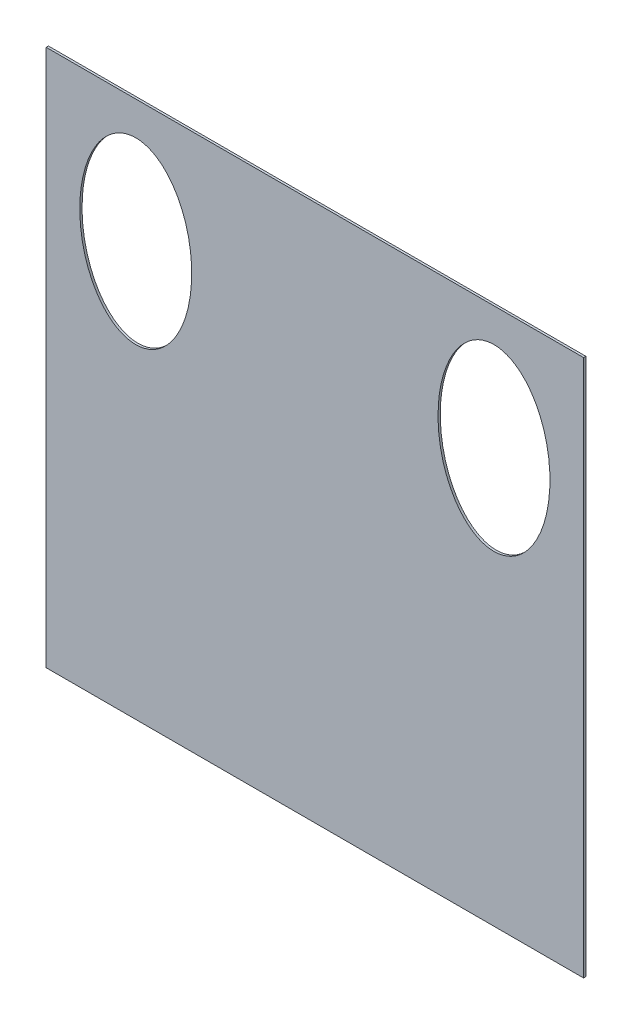
ISO-10303-21;
HEADER;
FILE_DESCRIPTION(('STEP AP214'),'2;1');
FILE_NAME('part.step','',(''),(''),'','','');
FILE_SCHEMA(('AUTOMOTIVE_DESIGN { 1 0 10303 214 1 1 1 1 }'));
ENDSEC;
DATA;
#1=APPLICATION_CONTEXT('core data for automotive mechanical design processes');
#2=APPLICATION_PROTOCOL_DEFINITION('international standard','automotive_design',2000,#1);
#3=PRODUCT_CONTEXT('',#1,'mechanical');
#4=PRODUCT('Part','Part','',(#3));
#5=PRODUCT_RELATED_PRODUCT_CATEGORY('part','',(#4));
#6=PRODUCT_DEFINITION_FORMATION('','',#4);
#7=PRODUCT_DEFINITION_CONTEXT('part definition',#1,'design');
#8=PRODUCT_DEFINITION('design','',#6,#7);
#9=PRODUCT_DEFINITION_SHAPE('','',#8);
#10=(LENGTH_UNIT() NAMED_UNIT(*) SI_UNIT(.MILLI.,.METRE.));
#11=(NAMED_UNIT(*) PLANE_ANGLE_UNIT() SI_UNIT($,.RADIAN.));
#12=(NAMED_UNIT(*) SI_UNIT($,.STERADIAN.) SOLID_ANGLE_UNIT());
#13=UNCERTAINTY_MEASURE_WITH_UNIT(LENGTH_MEASURE(1.E-05),#10,'distance_accuracy_value','');
#14=(GEOMETRIC_REPRESENTATION_CONTEXT(3) GLOBAL_UNCERTAINTY_ASSIGNED_CONTEXT((#13)) GLOBAL_UNIT_ASSIGNED_CONTEXT((#10,
#11,#12)) REPRESENTATION_CONTEXT('',''));
#15=CARTESIAN_POINT('',(0.,0.,0.));
#16=DIRECTION('',(0.,0.,1.));
#17=DIRECTION('',(1.,0.,0.));
#18=AXIS2_PLACEMENT_3D('',#15,#16,#17);
#19=CARTESIAN_POINT('',(-183.887603305785,299.132231404959,2.54));
#20=DIRECTION('',(1.,0.,0.));
#21=DIRECTION('',(0.,0.,-1.));
#22=AXIS2_PLACEMENT_3D('',#19,#20,#21);
#23=PLANE('',#22);
#24=DIRECTION('',(0.,-1.,0.));
#25=VECTOR('',#24,1.);
#26=CARTESIAN_POINT('',(-183.887603305785,299.132231404959,0.));
#27=LINE('',#26,#25);
#28=CARTESIAN_POINT('',(-183.887603305785,299.132231404959,0.));
#29=VERTEX_POINT('',#28);
#30=CARTESIAN_POINT('',(-183.887603305785,-310.467768595041,0.));
#31=VERTEX_POINT('',#30);
#32=EDGE_CURVE('E95',#29,#31,#27,.T.);
#33=ORIENTED_EDGE('',*,*,#32,.T.);
#34=DIRECTION('',(0.,0.,-1.));
#35=VECTOR('',#34,1.);
#36=CARTESIAN_POINT('',(-183.887603305785,-310.467768595041,2.54));
#37=LINE('',#36,#35);
#38=CARTESIAN_POINT('',(-183.887603305785,-310.467768595041,2.54));
#39=VERTEX_POINT('',#38);
#40=EDGE_CURVE('E11',#39,#31,#37,.T.);
#41=ORIENTED_EDGE('',*,*,#40,.F.);
#42=DIRECTION('',(0.,-1.,0.));
#43=VECTOR('',#42,1.);
#44=CARTESIAN_POINT('',(-183.887603305785,299.132231404959,2.54));
#45=LINE('',#44,#43);
#46=CARTESIAN_POINT('',(-183.887603305785,299.132231404959,2.54));
#47=VERTEX_POINT('',#46);
#48=EDGE_CURVE('E83',#47,#39,#45,.T.);
#49=ORIENTED_EDGE('',*,*,#48,.F.);
#50=DIRECTION('',(0.,0.,-1.));
#51=VECTOR('',#50,1.);
#52=CARTESIAN_POINT('',(-183.887603305785,299.132231404959,2.54));
#53=LINE('',#52,#51);
#54=EDGE_CURVE('E91',#47,#29,#53,.T.);
#55=ORIENTED_EDGE('',*,*,#54,.T.);
#56=EDGE_LOOP('',(#33,#41,#49,#55));
#57=FACE_BOUND('',#56,.T.);
#58=ADVANCED_FACE('F32',(#57),#23,.F.);
#59=CARTESIAN_POINT('',(-183.887603305785,-310.467768595041,2.54));
#60=DIRECTION('',(0.,1.,0.));
#61=DIRECTION('',(-1.,0.,0.));
#62=AXIS2_PLACEMENT_3D('',#59,#60,#61);
#63=PLANE('',#62);
#64=DIRECTION('',(1.,0.,0.));
#65=VECTOR('',#64,1.);
#66=CARTESIAN_POINT('',(-183.887603305785,-310.467768595041,0.));
#67=LINE('',#66,#65);
#68=CARTESIAN_POINT('',(425.712396694215,-310.467768595041,0.));
#69=VERTEX_POINT('',#68);
#70=EDGE_CURVE('E87',#31,#69,#67,.T.);
#71=ORIENTED_EDGE('',*,*,#70,.T.);
#72=DIRECTION('',(0.,0.,-1.));
#73=VECTOR('',#72,1.);
#74=CARTESIAN_POINT('',(425.712396694215,-310.467768595041,2.54));
#75=LINE('',#74,#73);
#76=CARTESIAN_POINT('',(425.712396694215,-310.467768595041,2.54));
#77=VERTEX_POINT('',#76);
#78=EDGE_CURVE('E40',#77,#69,#75,.T.);
#79=ORIENTED_EDGE('',*,*,#78,.F.);
#80=DIRECTION('',(1.,0.,0.));
#81=VECTOR('',#80,1.);
#82=CARTESIAN_POINT('',(-183.887603305785,-310.467768595041,2.54));
#83=LINE('',#82,#81);
#84=EDGE_CURVE('E78',#39,#77,#83,.T.);
#85=ORIENTED_EDGE('',*,*,#84,.F.);
#86=ORIENTED_EDGE('',*,*,#40,.T.);
#87=EDGE_LOOP('',(#71,#79,#85,#86));
#88=FACE_BOUND('',#87,.T.);
#89=ADVANCED_FACE('F86',(#88),#63,.F.);
#90=CARTESIAN_POINT('',(425.712396694215,299.132231404959,2.54));
#91=DIRECTION('',(-1.,0.,0.));
#92=DIRECTION('',(0.,-1.,0.));
#93=AXIS2_PLACEMENT_3D('',#90,#91,#92);
#94=PLANE('',#93);
#95=DIRECTION('',(0.,1.,0.));
#96=VECTOR('',#95,1.);
#97=CARTESIAN_POINT('',(425.712396694215,299.132231404959,0.));
#98=LINE('',#97,#96);
#99=CARTESIAN_POINT('',(425.712396694215,299.132231404959,0.));
#100=VERTEX_POINT('',#99);
#101=EDGE_CURVE('E65',#69,#100,#98,.T.);
#102=ORIENTED_EDGE('',*,*,#101,.T.);
#103=DIRECTION('',(0.,0.,-1.));
#104=VECTOR('',#103,1.);
#105=CARTESIAN_POINT('',(425.712396694215,299.132231404959,2.54));
#106=LINE('',#105,#104);
#107=CARTESIAN_POINT('',(425.712396694215,299.132231404959,2.54));
#108=VERTEX_POINT('',#107);
#109=EDGE_CURVE('E88',#108,#100,#106,.T.);
#110=ORIENTED_EDGE('',*,*,#109,.F.);
#111=DIRECTION('',(0.,1.,0.));
#112=VECTOR('',#111,1.);
#113=CARTESIAN_POINT('',(425.712396694215,299.132231404959,2.54));
#114=LINE('',#113,#112);
#115=EDGE_CURVE('E81',#77,#108,#114,.T.);
#116=ORIENTED_EDGE('',*,*,#115,.F.);
#117=ORIENTED_EDGE('',*,*,#78,.T.);
#118=EDGE_LOOP('',(#102,#110,#116,#117));
#119=FACE_BOUND('',#118,.T.);
#120=ADVANCED_FACE('F89',(#119),#94,.F.);
#121=CARTESIAN_POINT('',(-183.887603305785,299.132231404959,2.54));
#122=DIRECTION('',(0.,-1.,0.));
#123=DIRECTION('',(0.,0.,-1.));
#124=AXIS2_PLACEMENT_3D('',#121,#122,#123);
#125=PLANE('',#124);
#126=DIRECTION('',(-1.,0.,0.));
#127=VECTOR('',#126,1.);
#128=CARTESIAN_POINT('',(-183.887603305785,299.132231404959,0.));
#129=LINE('',#128,#127);
#130=EDGE_CURVE('E71',#100,#29,#129,.T.);
#131=ORIENTED_EDGE('',*,*,#130,.T.);
#132=ORIENTED_EDGE('',*,*,#54,.F.);
#133=DIRECTION('',(-1.,0.,0.));
#134=VECTOR('',#133,1.);
#135=CARTESIAN_POINT('',(-183.887603305785,299.132231404959,2.54));
#136=LINE('',#135,#134);
#137=EDGE_CURVE('E48',#108,#47,#136,.T.);
#138=ORIENTED_EDGE('',*,*,#137,.F.);
#139=ORIENTED_EDGE('',*,*,#109,.T.);
#140=EDGE_LOOP('',(#131,#132,#138,#139));
#141=FACE_BOUND('',#140,.T.);
#142=ADVANCED_FACE('F103',(#141),#125,.F.);
#143=CARTESIAN_POINT('',(0.,0.,2.54));
#144=DIRECTION('',(0.,0.,1.));
#145=DIRECTION('',(1.,0.,0.));
#146=AXIS2_PLACEMENT_3D('',#143,#144,#145);
#147=PLANE('',#146);
#148=CARTESIAN_POINT('',(-82.2876033057849,159.432231404959,2.54));
#149=DIRECTION('',(0.,0.,1.));
#150=DIRECTION('',(0.,-1.,0.));
#151=AXIS2_PLACEMENT_3D('',#148,#149,#150);
#152=ELLIPSE('',#151,101.6,63.5);
#153=CARTESIAN_POINT('',(-82.2876033057849,57.8322314049587,2.54));
#154=VERTEX_POINT('',#153);
#155=EDGE_CURVE('E116',#154,#154,#152,.T.);
#156=ORIENTED_EDGE('',*,*,#155,.F.);
#157=EDGE_LOOP('',(#156));
#158=FACE_BOUND('',#157,.T.);
#159=CARTESIAN_POINT('',(324.112396694215,159.432231404959,2.54));
#160=DIRECTION('',(0.,0.,1.));
#161=DIRECTION('',(0.,-1.,0.));
#162=AXIS2_PLACEMENT_3D('',#159,#160,#161);
#163=ELLIPSE('',#162,101.6,63.5);
#164=CARTESIAN_POINT('',(324.112396694215,57.8322314049586,2.54));
#165=VERTEX_POINT('',#164);
#166=EDGE_CURVE('E109',#165,#165,#163,.T.);
#167=ORIENTED_EDGE('',*,*,#166,.F.);
#168=EDGE_LOOP('',(#167));
#169=FACE_BOUND('',#168,.T.);
#170=ORIENTED_EDGE('',*,*,#48,.T.);
#171=ORIENTED_EDGE('',*,*,#84,.T.);
#172=ORIENTED_EDGE('',*,*,#115,.T.);
#173=ORIENTED_EDGE('',*,*,#137,.T.);
#174=EDGE_LOOP('',(#170,#171,#172,#173));
#175=FACE_BOUND('',#174,.T.);
#176=ADVANCED_FACE('F79',(#158,#169,#175),#147,.T.);
#177=CARTESIAN_POINT('',(0.,0.,0.));
#178=DIRECTION('',(0.,0.,1.));
#179=DIRECTION('',(1.,0.,0.));
#180=AXIS2_PLACEMENT_3D('',#177,#178,#179);
#181=PLANE('',#180);
#182=CARTESIAN_POINT('',(-82.2876033057849,159.432231404959,0.));
#183=DIRECTION('',(0.,0.,1.));
#184=DIRECTION('',(0.,-1.,0.));
#185=AXIS2_PLACEMENT_3D('',#182,#183,#184);
#186=ELLIPSE('',#185,101.6,63.5);
#187=CARTESIAN_POINT('',(-82.2876033057849,57.8322314049587,0.));
#188=VERTEX_POINT('',#187);
#189=EDGE_CURVE('E98',#188,#188,#186,.T.);
#190=ORIENTED_EDGE('',*,*,#189,.T.);
#191=EDGE_LOOP('',(#190));
#192=FACE_BOUND('',#191,.T.);
#193=CARTESIAN_POINT('',(324.112396694215,159.432231404959,0.));
#194=DIRECTION('',(0.,0.,1.));
#195=DIRECTION('',(0.,-1.,0.));
#196=AXIS2_PLACEMENT_3D('',#193,#194,#195);
#197=ELLIPSE('',#196,101.6,63.5);
#198=CARTESIAN_POINT('',(324.112396694215,57.8322314049586,0.));
#199=VERTEX_POINT('',#198);
#200=EDGE_CURVE('E112',#199,#199,#197,.T.);
#201=ORIENTED_EDGE('',*,*,#200,.T.);
#202=EDGE_LOOP('',(#201));
#203=FACE_BOUND('',#202,.T.);
#204=ORIENTED_EDGE('',*,*,#32,.F.);
#205=ORIENTED_EDGE('',*,*,#130,.F.);
#206=ORIENTED_EDGE('',*,*,#101,.F.);
#207=ORIENTED_EDGE('',*,*,#70,.F.);
#208=EDGE_LOOP('',(#204,#205,#206,#207));
#209=FACE_BOUND('',#208,.T.);
#210=ADVANCED_FACE('F106',(#192,#203,#209),#181,.F.);
#211=DIRECTION('',(0.,0.,1.));
#212=VECTOR('',#211,1.);
#213=SURFACE_OF_LINEAR_EXTRUSION('',#197,#212);
#214=ORIENTED_EDGE('',*,*,#200,.F.);
#215=EDGE_LOOP('',(#214));
#216=FACE_BOUND('',#215,.T.);
#217=ORIENTED_EDGE('',*,*,#166,.T.);
#218=EDGE_LOOP('',(#217));
#219=FACE_BOUND('',#218,.T.);
#220=ADVANCED_FACE('F119',(#216,#219),#213,.F.);
#221=DIRECTION('',(0.,0.,1.));
#222=VECTOR('',#221,1.);
#223=SURFACE_OF_LINEAR_EXTRUSION('',#186,#222);
#224=ORIENTED_EDGE('',*,*,#189,.F.);
#225=EDGE_LOOP('',(#224));
#226=FACE_BOUND('',#225,.T.);
#227=ORIENTED_EDGE('',*,*,#155,.T.);
#228=EDGE_LOOP('',(#227));
#229=FACE_BOUND('',#228,.T.);
#230=ADVANCED_FACE('F123',(#226,#229),#223,.F.);
#231=CLOSED_SHELL('',(#58,#89,#120,#142,#176,#210,#220,#230));
#232=MANIFOLD_SOLID_BREP('B2',#231);
#233=ADVANCED_BREP_SHAPE_REPRESENTATION('',(#18,#232),#14);
#234=SHAPE_DEFINITION_REPRESENTATION(#9,#233);
ENDSEC;
END-ISO-10303-21;
